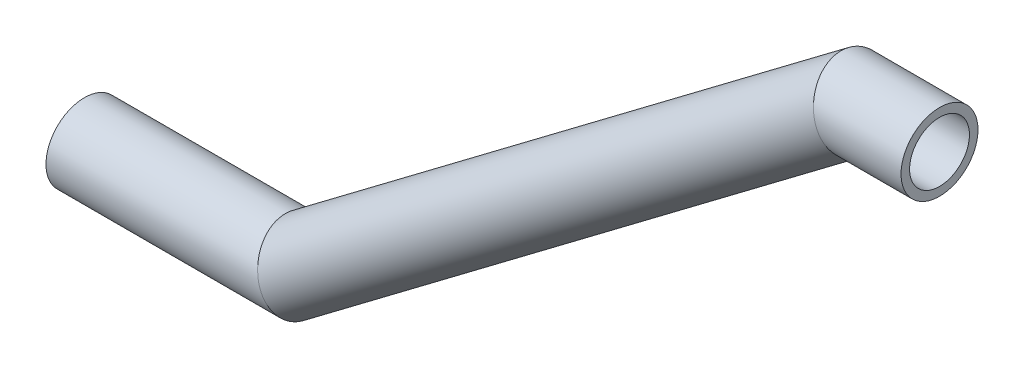
ISO-10303-21;
HEADER;
FILE_DESCRIPTION(('STEP AP214'),'2;1');
FILE_NAME('part.step','',(''),(''),'','','');
FILE_SCHEMA(('AUTOMOTIVE_DESIGN { 1 0 10303 214 1 1 1 1 }'));
ENDSEC;
DATA;
#1=APPLICATION_CONTEXT('core data for automotive mechanical design processes');
#2=APPLICATION_PROTOCOL_DEFINITION('international standard','automotive_design',2000,#1);
#3=PRODUCT_CONTEXT('',#1,'mechanical');
#4=PRODUCT('Part','Part','',(#3));
#5=PRODUCT_RELATED_PRODUCT_CATEGORY('part','',(#4));
#6=PRODUCT_DEFINITION_FORMATION('','',#4);
#7=PRODUCT_DEFINITION_CONTEXT('part definition',#1,'design');
#8=PRODUCT_DEFINITION('design','',#6,#7);
#9=PRODUCT_DEFINITION_SHAPE('','',#8);
#10=(LENGTH_UNIT() NAMED_UNIT(*) SI_UNIT(.MILLI.,.METRE.));
#11=(NAMED_UNIT(*) PLANE_ANGLE_UNIT() SI_UNIT($,.RADIAN.));
#12=(NAMED_UNIT(*) SI_UNIT($,.STERADIAN.) SOLID_ANGLE_UNIT());
#13=UNCERTAINTY_MEASURE_WITH_UNIT(LENGTH_MEASURE(1.E-05),#10,'distance_accuracy_value','');
#14=(GEOMETRIC_REPRESENTATION_CONTEXT(3) GLOBAL_UNCERTAINTY_ASSIGNED_CONTEXT((#13)) GLOBAL_UNIT_ASSIGNED_CONTEXT((#10,
#11,#12)) REPRESENTATION_CONTEXT('',''));
#15=CARTESIAN_POINT('',(0.,0.,0.));
#16=DIRECTION('',(0.,0.,1.));
#17=DIRECTION('',(1.,0.,0.));
#18=AXIS2_PLACEMENT_3D('',#15,#16,#17);
#19=CARTESIAN_POINT('',(3.4135190291584,0.,0.));
#20=DIRECTION('',(-1.,0.,0.));
#21=DIRECTION('',(0.,0.,1.));
#22=AXIS2_PLACEMENT_3D('',#19,#20,#21);
#23=CYLINDRICAL_SURFACE('',#22,4.5);
#24=CARTESIAN_POINT('',(0.,0.,0.));
#25=DIRECTION('',(-0.948294096850248,-0.317392983348674,0.));
#26=DIRECTION('',(0.317392983348674,-0.948294096850248,0.));
#27=AXIS2_PLACEMENT_3D('',#24,#25,#26);
#28=ELLIPSE('',#27,4.74536329493847,4.5);
#29=CARTESIAN_POINT('',(1.50614501325382,-4.50000000000001,0.));
#30=VERTEX_POINT('',#29);
#31=EDGE_CURVE('E38',#30,#30,#28,.T.);
#32=ORIENTED_EDGE('',*,*,#31,.T.);
#33=EDGE_LOOP('',(#32));
#34=FACE_BOUND('',#33,.T.);
#35=CARTESIAN_POINT('',(-25.,0.,0.));
#36=DIRECTION('',(1.,0.,0.));
#37=DIRECTION('',(0.,0.,-1.));
#38=AXIS2_PLACEMENT_3D('',#35,#36,#37);
#39=CIRCLE('',#38,4.5);
#40=CARTESIAN_POINT('',(-25.,0.,-4.5));
#41=VERTEX_POINT('',#40);
#42=EDGE_CURVE('E49',#41,#41,#39,.T.);
#43=ORIENTED_EDGE('',*,*,#42,.T.);
#44=EDGE_LOOP('',(#43));
#45=FACE_BOUND('',#44,.T.);
#46=ADVANCED_FACE('F35',(#34,#45),#23,.T.);
#47=CARTESIAN_POINT('',(67.7257747809923,51.0548148349019,0.));
#48=DIRECTION('',(-0.798523388242057,-0.601963784982474,0.));
#49=DIRECTION('',(0.601963784982474,-0.798523388242057,0.));
#50=AXIS2_PLACEMENT_3D('',#47,#48,#49);
#51=CYLINDRICAL_SURFACE('',#50,4.5);
#52=CARTESIAN_POINT('',(65.,49.,0.));
#53=DIRECTION('',(-0.948294096850248,-0.317392983348674,0.));
#54=DIRECTION('',(-0.317392983348674,0.948294096850249,0.));
#55=AXIS2_PLACEMENT_3D('',#52,#53,#54);
#56=ELLIPSE('',#55,4.74536329493847,4.5);
#57=CARTESIAN_POINT('',(63.4938549867462,53.5,0.));
#58=VERTEX_POINT('',#57);
#59=EDGE_CURVE('E87',#58,#58,#56,.T.);
#60=ORIENTED_EDGE('',*,*,#59,.T.);
#61=EDGE_LOOP('',(#60));
#62=FACE_BOUND('',#61,.T.);
#63=ORIENTED_EDGE('',*,*,#31,.F.);
#64=EDGE_LOOP('',(#63));
#65=FACE_BOUND('',#64,.T.);
#66=ADVANCED_FACE('F93',(#62,#65),#51,.T.);
#67=CARTESIAN_POINT('',(75.,49.,0.));
#68=DIRECTION('',(-1.,0.,0.));
#69=DIRECTION('',(0.,0.,1.));
#70=AXIS2_PLACEMENT_3D('',#67,#68,#69);
#71=CYLINDRICAL_SURFACE('',#70,4.5);
#72=CARTESIAN_POINT('',(75.,49.,0.));
#73=DIRECTION('',(1.,0.,0.));
#74=DIRECTION('',(0.,0.,-1.));
#75=AXIS2_PLACEMENT_3D('',#72,#73,#74);
#76=CIRCLE('',#75,4.5);
#77=CARTESIAN_POINT('',(75.,49.,-4.5));
#78=VERTEX_POINT('',#77);
#79=EDGE_CURVE('E55',#78,#78,#76,.T.);
#80=ORIENTED_EDGE('',*,*,#79,.F.);
#81=EDGE_LOOP('',(#80));
#82=FACE_BOUND('',#81,.T.);
#83=ORIENTED_EDGE('',*,*,#59,.F.);
#84=EDGE_LOOP('',(#83));
#85=FACE_BOUND('',#84,.T.);
#86=ADVANCED_FACE('F97',(#82,#85),#71,.T.);
#87=CARTESIAN_POINT('',(-25.,0.,0.));
#88=DIRECTION('',(1.,0.,0.));
#89=DIRECTION('',(0.,0.,-1.));
#90=AXIS2_PLACEMENT_3D('',#87,#88,#89);
#91=PLANE('',#90);
#92=CARTESIAN_POINT('',(-25.,0.,0.));
#93=DIRECTION('',(1.,0.,0.));
#94=DIRECTION('',(0.,0.,-1.));
#95=AXIS2_PLACEMENT_3D('',#92,#93,#94);
#96=CIRCLE('',#95,3.5);
#97=CARTESIAN_POINT('',(-25.,0.,-3.5));
#98=VERTEX_POINT('',#97);
#99=EDGE_CURVE('E80',#98,#98,#96,.F.);
#100=ORIENTED_EDGE('',*,*,#99,.F.);
#101=EDGE_LOOP('',(#100));
#102=FACE_BOUND('',#101,.T.);
#103=ORIENTED_EDGE('',*,*,#42,.F.);
#104=EDGE_LOOP('',(#103));
#105=FACE_BOUND('',#104,.T.);
#106=ADVANCED_FACE('F114',(#102,#105),#91,.F.);
#107=CARTESIAN_POINT('',(75.,49.,0.));
#108=DIRECTION('',(1.,0.,0.));
#109=DIRECTION('',(0.,0.,-1.));
#110=AXIS2_PLACEMENT_3D('',#107,#108,#109);
#111=PLANE('',#110);
#112=CARTESIAN_POINT('',(75.,49.,0.));
#113=DIRECTION('',(1.,0.,0.));
#114=DIRECTION('',(0.,0.,-1.));
#115=AXIS2_PLACEMENT_3D('',#112,#113,#114);
#116=CIRCLE('',#115,3.5);
#117=CARTESIAN_POINT('',(75.,49.,-3.5));
#118=VERTEX_POINT('',#117);
#119=EDGE_CURVE('E43',#118,#118,#116,.F.);
#120=ORIENTED_EDGE('',*,*,#119,.T.);
#121=EDGE_LOOP('',(#120));
#122=FACE_BOUND('',#121,.T.);
#123=ORIENTED_EDGE('',*,*,#79,.T.);
#124=EDGE_LOOP('',(#123));
#125=FACE_BOUND('',#124,.T.);
#126=ADVANCED_FACE('F111',(#122,#125),#111,.T.);
#127=CARTESIAN_POINT('',(2.6771814671232,0.,0.));
#128=DIRECTION('',(-1.,0.,0.));
#129=DIRECTION('',(0.,0.,1.));
#130=AXIS2_PLACEMENT_3D('',#127,#128,#129);
#131=CYLINDRICAL_SURFACE('',#130,3.5);
#132=CARTESIAN_POINT('',(0.,0.,0.));
#133=DIRECTION('',(-0.948294096850248,-0.317392983348674,0.));
#134=DIRECTION('',(0.317392983348674,-0.948294096850248,0.));
#135=AXIS2_PLACEMENT_3D('',#132,#133,#134);
#136=ELLIPSE('',#135,3.69083811828548,3.5);
#137=CARTESIAN_POINT('',(1.17144612141964,-3.50000000000001,0.));
#138=VERTEX_POINT('',#137);
#139=EDGE_CURVE('E77',#138,#138,#136,.F.);
#140=ORIENTED_EDGE('',*,*,#139,.T.);
#141=EDGE_LOOP('',(#140));
#142=FACE_BOUND('',#141,.T.);
#143=ORIENTED_EDGE('',*,*,#99,.T.);
#144=EDGE_LOOP('',(#143));
#145=FACE_BOUND('',#144,.T.);
#146=ADVANCED_FACE('F105',(#142,#145),#131,.F.);
#147=CARTESIAN_POINT('',(67.137792016066,50.6115662890344,0.));
#148=DIRECTION('',(-0.798523388242057,-0.601963784982474,0.));
#149=DIRECTION('',(0.601963784982474,-0.798523388242057,0.));
#150=AXIS2_PLACEMENT_3D('',#147,#148,#149);
#151=CYLINDRICAL_SURFACE('',#150,3.5);
#152=CARTESIAN_POINT('',(65.,49.,0.));
#153=DIRECTION('',(-0.948294096850248,-0.317392983348674,0.));
#154=DIRECTION('',(-0.317392983348674,0.948294096850249,0.));
#155=AXIS2_PLACEMENT_3D('',#152,#153,#154);
#156=ELLIPSE('',#155,3.69083811828548,3.5);
#157=CARTESIAN_POINT('',(63.8285538785804,52.5,0.));
#158=VERTEX_POINT('',#157);
#159=EDGE_CURVE('E11',#158,#158,#156,.F.);
#160=ORIENTED_EDGE('',*,*,#159,.T.);
#161=EDGE_LOOP('',(#160));
#162=FACE_BOUND('',#161,.T.);
#163=ORIENTED_EDGE('',*,*,#139,.F.);
#164=EDGE_LOOP('',(#163));
#165=FACE_BOUND('',#164,.T.);
#166=ADVANCED_FACE('F78',(#162,#165),#151,.F.);
#167=CARTESIAN_POINT('',(75.,49.,0.));
#168=DIRECTION('',(-1.,0.,0.));
#169=DIRECTION('',(0.,0.,1.));
#170=AXIS2_PLACEMENT_3D('',#167,#168,#169);
#171=CYLINDRICAL_SURFACE('',#170,3.5);
#172=ORIENTED_EDGE('',*,*,#119,.F.);
#173=EDGE_LOOP('',(#172));
#174=FACE_BOUND('',#173,.T.);
#175=ORIENTED_EDGE('',*,*,#159,.F.);
#176=EDGE_LOOP('',(#175));
#177=FACE_BOUND('',#176,.T.);
#178=ADVANCED_FACE('F98',(#174,#177),#171,.F.);
#179=CLOSED_SHELL('',(#46,#66,#86,#106,#126,#146,#166,#178));
#180=MANIFOLD_SOLID_BREP('B2',#179);
#181=ADVANCED_BREP_SHAPE_REPRESENTATION('',(#18,#180),#14);
#182=SHAPE_DEFINITION_REPRESENTATION(#9,#181);
ENDSEC;
END-ISO-10303-21;
